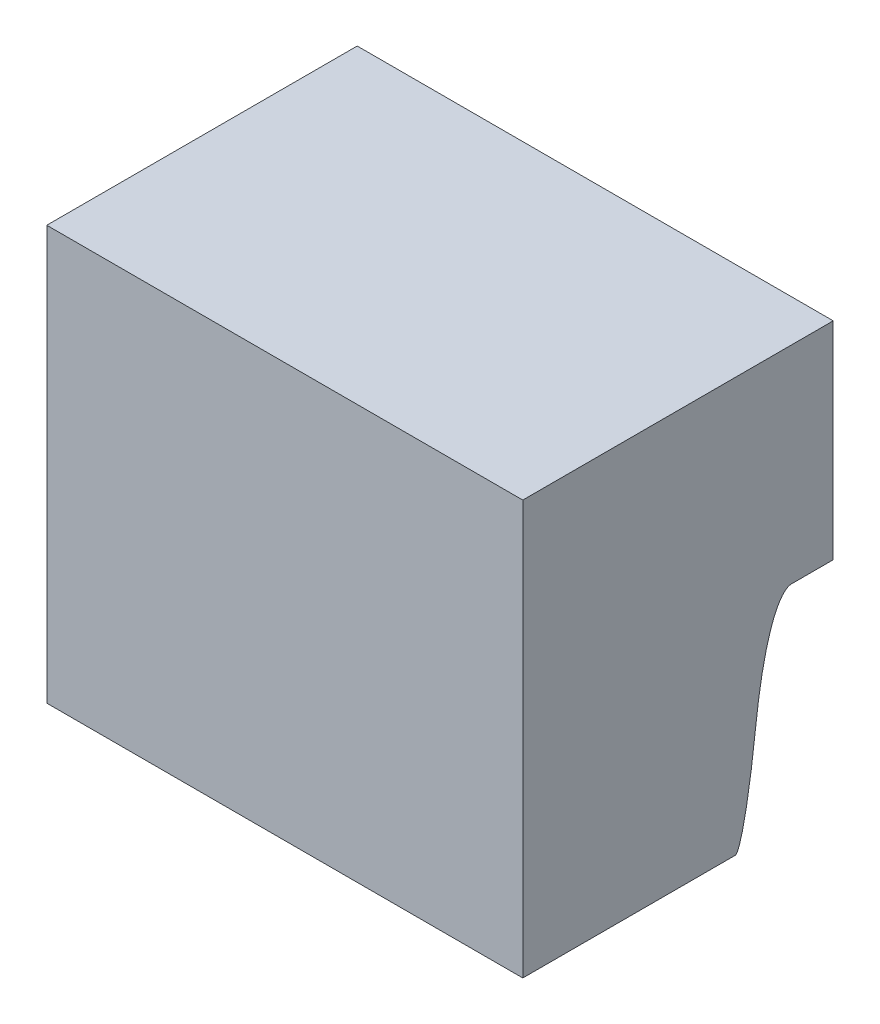
ISO-10303-21;
HEADER;
FILE_DESCRIPTION(('STEP AP214'),'2;1');
FILE_NAME('part.step','',(''),(''),'','','');
FILE_SCHEMA(('AUTOMOTIVE_DESIGN { 1 0 10303 214 1 1 1 1 }'));
ENDSEC;
DATA;
#1=APPLICATION_CONTEXT('core data for automotive mechanical design processes');
#2=APPLICATION_PROTOCOL_DEFINITION('international standard','automotive_design',2000,#1);
#3=PRODUCT_CONTEXT('',#1,'mechanical');
#4=PRODUCT('Part','Part','',(#3));
#5=PRODUCT_RELATED_PRODUCT_CATEGORY('part','',(#4));
#6=PRODUCT_DEFINITION_FORMATION('','',#4);
#7=PRODUCT_DEFINITION_CONTEXT('part definition',#1,'design');
#8=PRODUCT_DEFINITION('design','',#6,#7);
#9=PRODUCT_DEFINITION_SHAPE('','',#8);
#10=(LENGTH_UNIT() NAMED_UNIT(*) SI_UNIT(.MILLI.,.METRE.));
#11=(NAMED_UNIT(*) PLANE_ANGLE_UNIT() SI_UNIT($,.RADIAN.));
#12=(NAMED_UNIT(*) SI_UNIT($,.STERADIAN.) SOLID_ANGLE_UNIT());
#13=UNCERTAINTY_MEASURE_WITH_UNIT(LENGTH_MEASURE(1.E-05),#10,'distance_accuracy_value','');
#14=(GEOMETRIC_REPRESENTATION_CONTEXT(3) GLOBAL_UNCERTAINTY_ASSIGNED_CONTEXT((#13)) GLOBAL_UNIT_ASSIGNED_CONTEXT((#10,
#11,#12)) REPRESENTATION_CONTEXT('',''));
#15=CARTESIAN_POINT('',(0.,0.,0.));
#16=DIRECTION('',(0.,0.,1.));
#17=DIRECTION('',(1.,0.,0.));
#18=AXIS2_PLACEMENT_3D('',#15,#16,#17);
#19=CARTESIAN_POINT('',(0.,0.,26.));
#20=DIRECTION('',(0.,0.,1.));
#21=DIRECTION('',(1.,0.,0.));
#22=AXIS2_PLACEMENT_3D('',#19,#20,#21);
#23=PLANE('',#22);
#24=DIRECTION('',(-1.,0.,0.));
#25=VECTOR('',#24,1.);
#26=CARTESIAN_POINT('',(0.,123.,26.));
#27=LINE('',#26,#25);
#28=CARTESIAN_POINT('',(67.,123.,26.));
#29=VERTEX_POINT('',#28);
#30=CARTESIAN_POINT('',(46.,123.,26.));
#31=VERTEX_POINT('',#30);
#32=EDGE_CURVE('E60',#29,#31,#27,.T.);
#33=ORIENTED_EDGE('',*,*,#32,.F.);
#34=DIRECTION('',(0.,-1.,0.));
#35=VECTOR('',#34,1.);
#36=CARTESIAN_POINT('',(67.,0.,26.));
#37=LINE('',#36,#35);
#38=CARTESIAN_POINT('',(67.,114.,26.));
#39=VERTEX_POINT('',#38);
#40=EDGE_CURVE('E149',#29,#39,#37,.T.);
#41=ORIENTED_EDGE('',*,*,#40,.T.);
#42=CARTESIAN_POINT('',(43.85,114.,26.));
#43=CARTESIAN_POINT('',(52.2833333333333,114.,26.));
#44=CARTESIAN_POINT('',(60.7166666666667,114.,26.));
#45=CARTESIAN_POINT('',(69.15,114.,26.));
#46=(BOUNDED_CURVE() B_SPLINE_CURVE(3,(#42,#43,#44,#45),.UNSPECIFIED.,.F.,
.F.) B_SPLINE_CURVE_WITH_KNOTS((4,4),(-0.02415,0.00115),
.UNSPECIFIED.) CURVE() GEOMETRIC_REPRESENTATION_ITEM() RATIONAL_B_SPLINE_CURVE((1.,1.,1.,1.)) REPRESENTATION_ITEM(''));
#47=CARTESIAN_POINT('',(46.,114.,26.));
#48=VERTEX_POINT('',#47);
#49=EDGE_CURVE('E53',#39,#48,#46,.F.);
#50=ORIENTED_EDGE('',*,*,#49,.T.);
#51=DIRECTION('',(0.,1.,0.));
#52=VECTOR('',#51,1.);
#53=CARTESIAN_POINT('',(46.,0.,26.));
#54=LINE('',#53,#52);
#55=EDGE_CURVE('E65',#48,#31,#54,.T.);
#56=ORIENTED_EDGE('',*,*,#55,.T.);
#57=EDGE_LOOP('',(#33,#41,#50,#56));
#58=FACE_BOUND('',#57,.T.);
#59=ADVANCED_FACE('F43',(#58),#23,.F.);
#60=CARTESIAN_POINT('',(0.,104.,0.));
#61=DIRECTION('',(0.,-1.,0.));
#62=DIRECTION('',(0.,0.,-1.));
#63=AXIS2_PLACEMENT_3D('',#60,#61,#62);
#64=PLANE('',#63);
#65=DIRECTION('',(0.,0.,-1.));
#66=VECTOR('',#65,1.);
#67=CARTESIAN_POINT('',(45.,104.,39.));
#68=LINE('',#67,#66);
#69=CARTESIAN_POINT('',(45.,104.,39.));
#70=VERTEX_POINT('',#69);
#71=CARTESIAN_POINT('',(45.,104.,28.7385001548612));
#72=VERTEX_POINT('',#71);
#73=EDGE_CURVE('E590',#70,#72,#68,.T.);
#74=ORIENTED_EDGE('',*,*,#73,.T.);
#75=CARTESIAN_POINT('',(69.15,104.,28.7385001548569));
#76=CARTESIAN_POINT('',(60.7166666666667,104.,28.7385001546667));
#77=CARTESIAN_POINT('',(52.2833333333333,104.,28.7385001549008));
#78=CARTESIAN_POINT('',(43.85,104.,28.7385001548569));
#79=(BOUNDED_CURVE() B_SPLINE_CURVE(3,(#75,#76,#77,#78),.UNSPECIFIED.,.F.,
.F.) B_SPLINE_CURVE_WITH_KNOTS((4,4),(-0.01265,0.01265),
.UNSPECIFIED.) CURVE() GEOMETRIC_REPRESENTATION_ITEM() RATIONAL_B_SPLINE_CURVE((1.,1.,1.,1.)) REPRESENTATION_ITEM(''));
#80=CARTESIAN_POINT('',(68.,104.,28.7385001548336));
#81=VERTEX_POINT('',#80);
#82=EDGE_CURVE('E569',#72,#81,#79,.F.);
#83=ORIENTED_EDGE('',*,*,#82,.T.);
#84=DIRECTION('',(0.,0.,1.));
#85=VECTOR('',#84,1.);
#86=CARTESIAN_POINT('',(68.,104.,39.));
#87=LINE('',#86,#85);
#88=CARTESIAN_POINT('',(68.,104.,39.));
#89=VERTEX_POINT('',#88);
#90=EDGE_CURVE('E518',#81,#89,#87,.T.);
#91=ORIENTED_EDGE('',*,*,#90,.T.);
#92=DIRECTION('',(-1.,0.,0.));
#93=VECTOR('',#92,1.);
#94=CARTESIAN_POINT('',(45.,104.,39.));
#95=LINE('',#94,#93);
#96=EDGE_CURVE('E593',#89,#70,#95,.T.);
#97=ORIENTED_EDGE('',*,*,#96,.T.);
#98=EDGE_LOOP('',(#74,#83,#91,#97));
#99=FACE_BOUND('',#98,.T.);
#100=ADVANCED_FACE('F587',(#99),#64,.T.);
#101=CARTESIAN_POINT('',(0.,0.,39.));
#102=DIRECTION('',(0.,0.,1.));
#103=DIRECTION('',(1.,0.,0.));
#104=AXIS2_PLACEMENT_3D('',#101,#102,#103);
#105=PLANE('',#104);
#106=DIRECTION('',(0.,-1.,0.));
#107=VECTOR('',#106,1.);
#108=CARTESIAN_POINT('',(45.,124.,39.));
#109=LINE('',#108,#107);
#110=CARTESIAN_POINT('',(45.,124.,39.));
#111=VERTEX_POINT('',#110);
#112=EDGE_CURVE('E594',#111,#70,#109,.T.);
#113=ORIENTED_EDGE('',*,*,#112,.T.);
#114=ORIENTED_EDGE('',*,*,#96,.F.);
#115=DIRECTION('',(0.,1.,0.));
#116=VECTOR('',#115,1.);
#117=CARTESIAN_POINT('',(68.,124.,39.));
#118=LINE('',#117,#116);
#119=CARTESIAN_POINT('',(68.,124.,39.));
#120=VERTEX_POINT('',#119);
#121=EDGE_CURVE('E591',#89,#120,#118,.T.);
#122=ORIENTED_EDGE('',*,*,#121,.T.);
#123=DIRECTION('',(-1.,0.,0.));
#124=VECTOR('',#123,1.);
#125=CARTESIAN_POINT('',(45.,124.,39.));
#126=LINE('',#125,#124);
#127=EDGE_CURVE('E135',#120,#111,#126,.T.);
#128=ORIENTED_EDGE('',*,*,#127,.T.);
#129=EDGE_LOOP('',(#113,#114,#122,#128));
#130=FACE_BOUND('',#129,.T.);
#131=ADVANCED_FACE('F247',(#130),#105,.T.);
#132=CARTESIAN_POINT('',(0.,124.,10.));
#133=DIRECTION('',(0.,1.,0.));
#134=DIRECTION('',(0.,0.,1.));
#135=AXIS2_PLACEMENT_3D('',#132,#133,#134);
#136=PLANE('',#135);
#137=DIRECTION('',(0.,0.,-1.));
#138=VECTOR('',#137,1.);
#139=CARTESIAN_POINT('',(68.,124.,39.));
#140=LINE('',#139,#138);
#141=CARTESIAN_POINT('',(68.,124.,24.));
#142=VERTEX_POINT('',#141);
#143=EDGE_CURVE('E129',#120,#142,#140,.T.);
#144=ORIENTED_EDGE('',*,*,#143,.T.);
#145=DIRECTION('',(1.,0.,0.));
#146=VECTOR('',#145,1.);
#147=CARTESIAN_POINT('',(0.,124.,24.));
#148=LINE('',#147,#146);
#149=CARTESIAN_POINT('',(45.,124.,24.));
#150=VERTEX_POINT('',#149);
#151=EDGE_CURVE('E133',#150,#142,#148,.T.);
#152=ORIENTED_EDGE('',*,*,#151,.F.);
#153=DIRECTION('',(0.,0.,-1.));
#154=VECTOR('',#153,1.);
#155=CARTESIAN_POINT('',(45.,124.,39.));
#156=LINE('',#155,#154);
#157=EDGE_CURVE('E140',#111,#150,#156,.T.);
#158=ORIENTED_EDGE('',*,*,#157,.F.);
#159=ORIENTED_EDGE('',*,*,#127,.F.);
#160=EDGE_LOOP('',(#144,#152,#158,#159));
#161=FACE_BOUND('',#160,.T.);
#162=ADVANCED_FACE('F131',(#161),#136,.T.);
#163=CARTESIAN_POINT('',(45.,124.,39.));
#164=DIRECTION('',(1.,0.,0.));
#165=DIRECTION('',(0.,0.,-1.));
#166=AXIS2_PLACEMENT_3D('',#163,#164,#165);
#167=PLANE('',#166);
#168=ORIENTED_EDGE('',*,*,#157,.T.);
#169=DIRECTION('',(0.,-1.,0.));
#170=VECTOR('',#169,1.);
#171=CARTESIAN_POINT('',(45.,124.,24.));
#172=LINE('',#171,#170);
#173=CARTESIAN_POINT('',(45.,114.,24.));
#174=VERTEX_POINT('',#173);
#175=EDGE_CURVE('E148',#150,#174,#172,.T.);
#176=ORIENTED_EDGE('',*,*,#175,.T.);
#177=DIRECTION('',(0.,0.,1.));
#178=VECTOR('',#177,1.);
#179=CARTESIAN_POINT('',(45.,114.,24.));
#180=LINE('',#179,#178);
#181=CARTESIAN_POINT('',(45.,114.,26.));
#182=VERTEX_POINT('',#181);
#183=EDGE_CURVE('E611',#174,#182,#180,.T.);
#184=ORIENTED_EDGE('',*,*,#183,.T.);
#185=CARTESIAN_POINT('',(45.,104.,28.));
#186=CARTESIAN_POINT('',(45.,114.,28.0000000000001));
#187=CARTESIAN_POINT('',(45.,114.,26.));
#188=(BOUNDED_CURVE() B_SPLINE_CURVE(2,(#185,#186,#187),.UNSPECIFIED.,.F.,
.F.) B_SPLINE_CURVE_WITH_KNOTS((3,3),(0.,1.),
.UNSPECIFIED.) CURVE() GEOMETRIC_REPRESENTATION_ITEM() RATIONAL_B_SPLINE_CURVE((1.,
0.707106781186545,1.)) REPRESENTATION_ITEM(''));
#189=CARTESIAN_POINT('',(45.,108.888621021373,27.7447359640077));
#190=VERTEX_POINT('',#189);
#191=EDGE_CURVE('E222',#182,#190,#188,.F.);
#192=ORIENTED_EDGE('',*,*,#191,.T.);
#193=CARTESIAN_POINT('',(45.,104.,28.7385001548612));
#194=CARTESIAN_POINT('',(45.,103.999999999983,28.292628431377));
#195=CARTESIAN_POINT('',(45.,108.888619487019,27.7447223218741));
#196=(BOUNDED_CURVE() B_SPLINE_CURVE(2,(#193,#194,#195),.UNSPECIFIED.,.F.,
.F.) B_SPLINE_CURVE_WITH_KNOTS((3,3),(0.,1.),
.UNSPECIFIED.) CURVE() GEOMETRIC_REPRESENTATION_ITEM() RATIONAL_B_SPLINE_CURVE((1.,
0.745446347154539,1.)) REPRESENTATION_ITEM(''));
#197=EDGE_CURVE('E558',#190,#72,#196,.F.);
#198=ORIENTED_EDGE('',*,*,#197,.T.);
#199=ORIENTED_EDGE('',*,*,#73,.F.);
#200=ORIENTED_EDGE('',*,*,#112,.F.);
#201=EDGE_LOOP('',(#168,#176,#184,#192,#198,#199,#200));
#202=FACE_BOUND('',#201,.T.);
#203=ADVANCED_FACE('F248',(#202),#167,.F.);
#204=CARTESIAN_POINT('',(69.15,108.888619487028,27.7447223218731));
#205=CARTESIAN_POINT('',(60.7166666666667,108.888619486818,27.7447223218966));
#206=CARTESIAN_POINT('',(52.2833333333333,108.888619486965,27.7447223218801));
#207=CARTESIAN_POINT('',(43.85,108.888619487028,27.7447223218731));
#208=CARTESIAN_POINT('',(69.15,104.,28.2926284313862));
#209=CARTESIAN_POINT('',(60.7166666666667,103.999999999532,28.2926284289138));
#210=CARTESIAN_POINT('',(52.2833333333333,103.999999999883,28.29262843143));
#211=CARTESIAN_POINT('',(43.85,104.,28.2926284313862));
#212=CARTESIAN_POINT('',(69.15,104.,28.7385001548569));
#213=CARTESIAN_POINT('',(60.7166666666667,104.,28.7385001546667));
#214=CARTESIAN_POINT('',(52.2833333333333,104.,28.7385001549008));
#215=CARTESIAN_POINT('',(43.85,104.,28.7385001548569));
#216=(BOUNDED_SURFACE() B_SPLINE_SURFACE(2,3,((#204,#205,#206,#207),(#208,#209,#210,#211),(#212,
#213,#214,#215)),.UNSPECIFIED.,.F.,.F.,.F.) B_SPLINE_SURFACE_WITH_KNOTS((3,3),(4,4),(0.,1.),
(-0.01265,0.01265),
.UNSPECIFIED.) GEOMETRIC_REPRESENTATION_ITEM() RATIONAL_B_SPLINE_SURFACE(((1.,1.,1.,1.),
(0.745446347154539,0.745446347154539,0.745446347154539,0.745446347154539),(1.,1.,1.,1.))) REPRESENTATION_ITEM('') SURFACE());
#217=CARTESIAN_POINT('',(68.,108.888619487002,27.744722321876));
#218=CARTESIAN_POINT('',(67.0416666666667,108.888619487002,27.7447223218759));
#219=CARTESIAN_POINT('',(66.0833333333333,108.888619487003,27.7447223218759));
#220=CARTESIAN_POINT('',(64.1666666666667,108.888619487004,27.7447223218757));
#221=CARTESIAN_POINT('',(63.2083333333333,108.888619487005,27.7447223218756));
#222=CARTESIAN_POINT('',(61.2916666666667,108.888619487007,27.7447223218755));
#223=CARTESIAN_POINT('',(60.3333333333333,108.888619487007,27.7447223218754));
#224=CARTESIAN_POINT('',(58.4166666666667,108.888619487009,27.7447223218752));
#225=CARTESIAN_POINT('',(57.4583333333333,108.888619487009,27.7447223218751));
#226=CARTESIAN_POINT('',(55.5416666666667,108.888619487011,27.744722321875));
#227=CARTESIAN_POINT('',(54.5833333333334,108.888619487012,27.7447223218749));
#228=CARTESIAN_POINT('',(52.6666666666667,108.888619487013,27.7447223218747));
#229=CARTESIAN_POINT('',(51.7083333333334,108.888619487014,27.7447223218746));
#230=CARTESIAN_POINT('',(49.7916666666667,108.888619487015,27.7447223218745));
#231=CARTESIAN_POINT('',(48.8333333333334,108.888619487016,27.7447223218744));
#232=CARTESIAN_POINT('',(46.9166666666667,108.888619487017,27.7447223218742));
#233=CARTESIAN_POINT('',(45.9583333333333,108.888619487018,27.7447223218742));
#234=CARTESIAN_POINT('',(45.,108.888619487019,27.7447223218741));
#235=B_SPLINE_CURVE_WITH_KNOTS('',3,(#217,#218,#219,#220,#221,#222,#223,#224,#225,#226,#227,
#228,#229,#230,#231,#232,#233,#234),.UNSPECIFIED.,.F.,.F.,(4,2,2,2,2,2,2,2,4),(0.,
2.87500000000002,5.75000000000001,8.62500000000001,11.5,14.375,17.25,20.125,23.),.UNSPECIFIED.);
#236=CARTESIAN_POINT('',(68.,108.888621052951,27.7447363460782));
#237=VERTEX_POINT('',#236);
#238=EDGE_CURVE('E262',#237,#190,#235,.T.);
#239=CARTESIAN_POINT('',(68.,108.888619487001,27.744722321876));
#240=CARTESIAN_POINT('',(68.,103.999999999941,28.2926284310792));
#241=CARTESIAN_POINT('',(68.,104.,28.7385001548336));
#242=(BOUNDED_CURVE() B_SPLINE_CURVE(2,(#239,#240,#241),.UNSPECIFIED.,.F.,
.F.) B_SPLINE_CURVE_WITH_KNOTS((3,3),(0.,1.),
.UNSPECIFIED.) CURVE() GEOMETRIC_REPRESENTATION_ITEM() RATIONAL_B_SPLINE_CURVE((1.,
0.745446347154539,1.)) REPRESENTATION_ITEM(''));
#243=EDGE_CURVE('E220',#81,#237,#242,.F.);
#244=ORIENTED_EDGE('',*,*,#197,.F.);
#245=ORIENTED_EDGE('',*,*,#238,.F.);
#246=ORIENTED_EDGE('',*,*,#243,.F.);
#247=ORIENTED_EDGE('',*,*,#82,.F.);
#248=EDGE_LOOP('',(#244,#245,#246,#247));
#249=FACE_BOUND('',#248,.T.);
#250=ADVANCED_FACE('F246',(#249),#216,.T.);
#251=CARTESIAN_POINT('',(68.,124.,39.));
#252=DIRECTION('',(-1.,0.,0.));
#253=DIRECTION('',(0.,0.,1.));
#254=AXIS2_PLACEMENT_3D('',#251,#252,#253);
#255=PLANE('',#254);
#256=CARTESIAN_POINT('',(68.,114.,26.));
#257=CARTESIAN_POINT('',(68.,114.,28.0000000000001));
#258=CARTESIAN_POINT('',(68.,104.,28.));
#259=(BOUNDED_CURVE() B_SPLINE_CURVE(2,(#256,#257,#258),.UNSPECIFIED.,.F.,
.F.) B_SPLINE_CURVE_WITH_KNOTS((3,3),(0.,1.),
.UNSPECIFIED.) CURVE() GEOMETRIC_REPRESENTATION_ITEM() RATIONAL_B_SPLINE_CURVE((1.,
0.707106781186545,1.)) REPRESENTATION_ITEM(''));
#260=CARTESIAN_POINT('',(68.,114.,26.));
#261=VERTEX_POINT('',#260);
#262=EDGE_CURVE('E139',#237,#261,#259,.F.);
#263=ORIENTED_EDGE('',*,*,#262,.T.);
#264=DIRECTION('',(0.,0.,1.));
#265=VECTOR('',#264,1.);
#266=CARTESIAN_POINT('',(68.,114.,24.));
#267=LINE('',#266,#265);
#268=CARTESIAN_POINT('',(68.,114.,24.));
#269=VERTEX_POINT('',#268);
#270=EDGE_CURVE('E154',#269,#261,#267,.T.);
#271=ORIENTED_EDGE('',*,*,#270,.F.);
#272=DIRECTION('',(0.,1.,0.));
#273=VECTOR('',#272,1.);
#274=CARTESIAN_POINT('',(68.,124.,24.));
#275=LINE('',#274,#273);
#276=EDGE_CURVE('E146',#269,#142,#275,.T.);
#277=ORIENTED_EDGE('',*,*,#276,.T.);
#278=ORIENTED_EDGE('',*,*,#143,.F.);
#279=ORIENTED_EDGE('',*,*,#121,.F.);
#280=ORIENTED_EDGE('',*,*,#90,.F.);
#281=ORIENTED_EDGE('',*,*,#243,.T.);
#282=EDGE_LOOP('',(#263,#271,#277,#278,#279,#280,#281));
#283=FACE_BOUND('',#282,.T.);
#284=ADVANCED_FACE('F152',(#283),#255,.F.);
#285=CARTESIAN_POINT('',(69.15,114.,26.));
#286=CARTESIAN_POINT('',(60.7166666666667,114.,26.));
#287=CARTESIAN_POINT('',(52.2833333333333,114.,26.));
#288=CARTESIAN_POINT('',(43.85,114.,26.));
#289=CARTESIAN_POINT('',(69.15,114.,28.0000000000001));
#290=CARTESIAN_POINT('',(60.7166666666666,114.,28.0000000000001));
#291=CARTESIAN_POINT('',(52.2833333333334,114.,28.0000000000001));
#292=CARTESIAN_POINT('',(43.85,114.,28.0000000000001));
#293=CARTESIAN_POINT('',(69.15,104.,28.));
#294=CARTESIAN_POINT('',(60.7166666666667,104.,28.));
#295=CARTESIAN_POINT('',(52.2833333333333,104.,28.));
#296=CARTESIAN_POINT('',(43.85,104.,28.));
#297=(BOUNDED_SURFACE() B_SPLINE_SURFACE(2,3,((#285,#286,#287,#288),(#289,#290,#291,#292),(#293,
#294,#295,#296)),.UNSPECIFIED.,.F.,.F.,.F.) B_SPLINE_SURFACE_WITH_KNOTS((3,3),(4,4),(0.,1.),
(-0.02415,0.00115),
.UNSPECIFIED.) GEOMETRIC_REPRESENTATION_ITEM() RATIONAL_B_SPLINE_SURFACE(((1.,1.,1.,1.),
(0.707106781186545,0.707106781186545,0.707106781186545,0.707106781186545),(1.,1.,1.,1.))) REPRESENTATION_ITEM('') SURFACE());
#298=CARTESIAN_POINT('',(43.85,114.,26.));
#299=CARTESIAN_POINT('',(52.2833333333333,114.,26.));
#300=CARTESIAN_POINT('',(60.7166666666667,114.,26.));
#301=CARTESIAN_POINT('',(69.15,114.,26.));
#302=(BOUNDED_CURVE() B_SPLINE_CURVE(3,(#298,#299,#300,#301),.UNSPECIFIED.,.F.,
.F.) B_SPLINE_CURVE_WITH_KNOTS((4,4),(-0.02415,0.00115),
.UNSPECIFIED.) CURVE() GEOMETRIC_REPRESENTATION_ITEM() RATIONAL_B_SPLINE_CURVE((1.,1.,1.,1.)) REPRESENTATION_ITEM(''));
#303=EDGE_CURVE('E613',#48,#182,#302,.F.);
#304=CARTESIAN_POINT('',(43.85,114.,26.));
#305=CARTESIAN_POINT('',(52.2833333333333,114.,26.));
#306=CARTESIAN_POINT('',(60.7166666666667,114.,26.));
#307=CARTESIAN_POINT('',(69.15,114.,26.));
#308=(BOUNDED_CURVE() B_SPLINE_CURVE(3,(#304,#305,#306,#307),.UNSPECIFIED.,.F.,
.F.) B_SPLINE_CURVE_WITH_KNOTS((4,4),(-0.02415,0.00115),
.UNSPECIFIED.) CURVE() GEOMETRIC_REPRESENTATION_ITEM() RATIONAL_B_SPLINE_CURVE((1.,1.,1.,1.)) REPRESENTATION_ITEM(''));
#309=EDGE_CURVE('E13',#261,#39,#308,.F.);
#310=ORIENTED_EDGE('',*,*,#262,.F.);
#311=ORIENTED_EDGE('',*,*,#238,.T.);
#312=ORIENTED_EDGE('',*,*,#191,.F.);
#313=ORIENTED_EDGE('',*,*,#303,.F.);
#314=ORIENTED_EDGE('',*,*,#49,.F.);
#315=ORIENTED_EDGE('',*,*,#309,.F.);
#316=EDGE_LOOP('',(#310,#311,#312,#313,#314,#315));
#317=FACE_BOUND('',#316,.T.);
#318=ADVANCED_FACE('F214',(#317),#297,.T.);
#319=CARTESIAN_POINT('',(67.,0.,26.));
#320=DIRECTION('',(-0.998629534754574,0.,-0.0523359562429438));
#321=DIRECTION('',(-0.0523359562429438,0.,0.998629534754574));
#322=AXIS2_PLACEMENT_3D('',#319,#320,#321);
#323=PLANE('',#322);
#324=ORIENTED_EDGE('',*,*,#40,.F.);
#325=DIRECTION('',(0.0522644276887139,0.0522644276887139,-0.997264688634237));
#326=VECTOR('',#325,1.);
#327=CARTESIAN_POINT('',(66.8169847830909,122.816984783091,29.4921383697773));
#328=LINE('',#327,#326);
#329=CARTESIAN_POINT('',(67.1048155585661,123.104815558566,24.));
#330=VERTEX_POINT('',#329);
#331=EDGE_CURVE('E596',#330,#29,#328,.F.);
#332=ORIENTED_EDGE('',*,*,#331,.F.);
#333=DIRECTION('',(0.,-1.,0.));
#334=VECTOR('',#333,1.);
#335=CARTESIAN_POINT('',(67.1048155585661,0.,24.));
#336=LINE('',#335,#334);
#337=CARTESIAN_POINT('',(67.1048155585661,114.,24.));
#338=VERTEX_POINT('',#337);
#339=EDGE_CURVE('E780',#330,#338,#336,.T.);
#340=ORIENTED_EDGE('',*,*,#339,.T.);
#341=DIRECTION('',(-0.0523359562429438,0.,0.998629534754574));
#342=VECTOR('',#341,1.);
#343=CARTESIAN_POINT('',(66.9210119581048,114.,27.5071816240981));
#344=LINE('',#343,#342);
#345=EDGE_CURVE('E209',#338,#39,#344,.T.);
#346=ORIENTED_EDGE('',*,*,#345,.T.);
#347=EDGE_LOOP('',(#324,#332,#340,#346));
#348=FACE_BOUND('',#347,.T.);
#349=ADVANCED_FACE('F281',(#348),#323,.T.);
#350=CARTESIAN_POINT('',(0.,123.,26.));
#351=DIRECTION('',(0.,-0.998629534754574,-0.0523359562429438));
#352=DIRECTION('',(0.,0.0523359562429438,-0.998629534754574));
#353=AXIS2_PLACEMENT_3D('',#350,#351,#352);
#354=PLANE('',#353);
#355=ORIENTED_EDGE('',*,*,#32,.T.);
#356=DIRECTION('',(-0.0522644276887139,0.0522644276887139,-0.997264688634237));
#357=VECTOR('',#356,1.);
#358=CARTESIAN_POINT('',(46.3359831594003,122.6640168406,32.4109405892927));
#359=LINE('',#358,#357);
#360=CARTESIAN_POINT('',(45.8951844414339,123.104815558566,24.));
#361=VERTEX_POINT('',#360);
#362=EDGE_CURVE('E598',#361,#31,#359,.F.);
#363=ORIENTED_EDGE('',*,*,#362,.F.);
#364=DIRECTION('',(1.,0.,0.));
#365=VECTOR('',#364,1.);
#366=CARTESIAN_POINT('',(0.,123.104815558566,24.));
#367=LINE('',#366,#365);
#368=EDGE_CURVE('E773',#330,#361,#367,.F.);
#369=ORIENTED_EDGE('',*,*,#368,.F.);
#370=ORIENTED_EDGE('',*,*,#331,.T.);
#371=EDGE_LOOP('',(#355,#363,#369,#370));
#372=FACE_BOUND('',#371,.T.);
#373=ADVANCED_FACE('F728',(#372),#354,.T.);
#374=CARTESIAN_POINT('',(46.,0.,26.));
#375=DIRECTION('',(0.998629534754574,0.,-0.0523359562429438));
#376=DIRECTION('',(-0.0523359562429438,0.,-0.998629534754574));
#377=AXIS2_PLACEMENT_3D('',#374,#375,#376);
#378=PLANE('',#377);
#379=ORIENTED_EDGE('',*,*,#55,.F.);
#380=DIRECTION('',(0.0523359562429438,0.,0.998629534754574));
#381=VECTOR('',#380,1.);
#382=CARTESIAN_POINT('',(46.,114.,26.));
#383=LINE('',#382,#381);
#384=CARTESIAN_POINT('',(45.8951844414339,114.,24.));
#385=VERTEX_POINT('',#384);
#386=EDGE_CURVE('E627',#385,#48,#383,.T.);
#387=ORIENTED_EDGE('',*,*,#386,.F.);
#388=DIRECTION('',(0.,1.,0.));
#389=VECTOR('',#388,1.);
#390=CARTESIAN_POINT('',(45.8951844414339,0.,24.));
#391=LINE('',#390,#389);
#392=EDGE_CURVE('E164',#385,#361,#391,.T.);
#393=ORIENTED_EDGE('',*,*,#392,.T.);
#394=ORIENTED_EDGE('',*,*,#362,.T.);
#395=EDGE_LOOP('',(#379,#387,#393,#394));
#396=FACE_BOUND('',#395,.T.);
#397=ADVANCED_FACE('F737',(#396),#378,.T.);
#398=CARTESIAN_POINT('',(0.,114.,24.));
#399=DIRECTION('',(0.,1.,0.));
#400=DIRECTION('',(0.,0.,1.));
#401=AXIS2_PLACEMENT_3D('',#398,#399,#400);
#402=PLANE('',#401);
#403=ORIENTED_EDGE('',*,*,#303,.T.);
#404=ORIENTED_EDGE('',*,*,#183,.F.);
#405=CARTESIAN_POINT('',(45.8951844414339,114.,24.));
#406=DIRECTION('',(-1.,0.,0.));
#407=VECTOR('',#406,1.);
#408=LINE('',#405,#407);
#409=EDGE_CURVE('E156',#385,#174,#408,.T.);
#410=ORIENTED_EDGE('',*,*,#409,.F.);
#411=ORIENTED_EDGE('',*,*,#386,.T.);
#412=EDGE_LOOP('',(#403,#404,#410,#411));
#413=FACE_BOUND('',#412,.T.);
#414=ADVANCED_FACE('F189',(#413),#402,.F.);
#415=CARTESIAN_POINT('',(0.,114.,24.));
#416=DIRECTION('',(0.,1.,0.));
#417=DIRECTION('',(0.,0.,1.));
#418=AXIS2_PLACEMENT_3D('',#415,#416,#417);
#419=PLANE('',#418);
#420=ORIENTED_EDGE('',*,*,#309,.T.);
#421=ORIENTED_EDGE('',*,*,#345,.F.);
#422=CARTESIAN_POINT('',(68.,114.,24.));
#423=DIRECTION('',(-1.,0.,0.));
#424=VECTOR('',#423,1.);
#425=LINE('',#422,#424);
#426=EDGE_CURVE('E158',#269,#338,#425,.T.);
#427=ORIENTED_EDGE('',*,*,#426,.F.);
#428=ORIENTED_EDGE('',*,*,#270,.T.);
#429=EDGE_LOOP('',(#420,#421,#427,#428));
#430=FACE_BOUND('',#429,.T.);
#431=ADVANCED_FACE('F185',(#430),#419,.F.);
#432=CARTESIAN_POINT('',(0.,0.,24.));
#433=DIRECTION('',(0.,0.,1.));
#434=DIRECTION('',(1.,0.,0.));
#435=AXIS2_PLACEMENT_3D('',#432,#433,#434);
#436=PLANE('',#435);
#437=ORIENTED_EDGE('',*,*,#339,.F.);
#438=ORIENTED_EDGE('',*,*,#368,.T.);
#439=ORIENTED_EDGE('',*,*,#392,.F.);
#440=ORIENTED_EDGE('',*,*,#409,.T.);
#441=ORIENTED_EDGE('',*,*,#175,.F.);
#442=ORIENTED_EDGE('',*,*,#151,.T.);
#443=ORIENTED_EDGE('',*,*,#276,.F.);
#444=ORIENTED_EDGE('',*,*,#426,.T.);
#445=EDGE_LOOP('',(#437,#438,#439,#440,#441,#442,#443,#444));
#446=FACE_BOUND('',#445,.T.);
#447=ADVANCED_FACE('F145',(#446),#436,.F.);
#448=CLOSED_SHELL('',(#59,#100,#131,#162,#203,#250,#284,#318,#349,#373,#397,#414,#431,#447));
#449=MANIFOLD_SOLID_BREP('B2',#448);
#450=ADVANCED_BREP_SHAPE_REPRESENTATION('',(#18,#449),#14);
#451=SHAPE_DEFINITION_REPRESENTATION(#9,#450);
ENDSEC;
END-ISO-10303-21;
